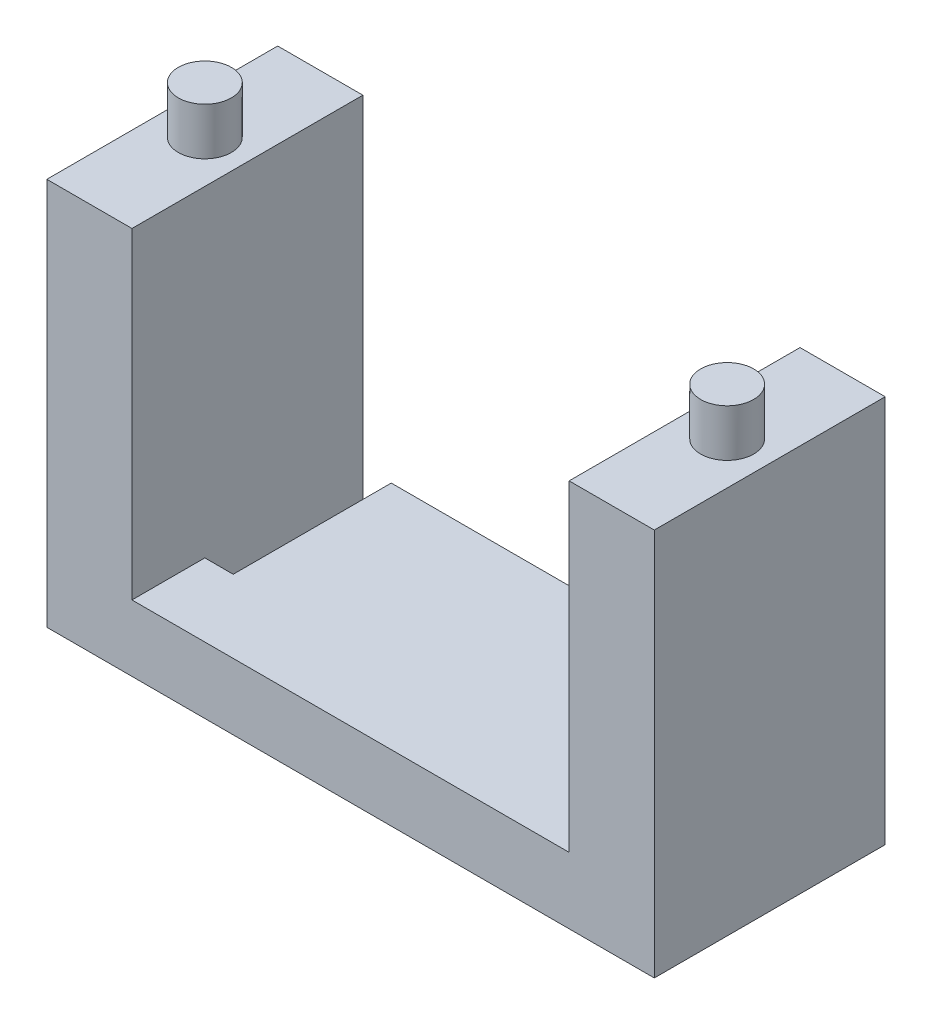
ISO-10303-21;
HEADER;
FILE_DESCRIPTION(('STEP AP214'),'2;1');
FILE_NAME('part.step','',(''),(''),'','','');
FILE_SCHEMA(('AUTOMOTIVE_DESIGN { 1 0 10303 214 1 1 1 1 }'));
ENDSEC;
DATA;
#1=APPLICATION_CONTEXT('core data for automotive mechanical design processes');
#2=APPLICATION_PROTOCOL_DEFINITION('international standard','automotive_design',2000,#1);
#3=PRODUCT_CONTEXT('',#1,'mechanical');
#4=PRODUCT('Part','Part','',(#3));
#5=PRODUCT_RELATED_PRODUCT_CATEGORY('part','',(#4));
#6=PRODUCT_DEFINITION_FORMATION('','',#4);
#7=PRODUCT_DEFINITION_CONTEXT('part definition',#1,'design');
#8=PRODUCT_DEFINITION('design','',#6,#7);
#9=PRODUCT_DEFINITION_SHAPE('','',#8);
#10=(LENGTH_UNIT() NAMED_UNIT(*) SI_UNIT(.MILLI.,.METRE.));
#11=(NAMED_UNIT(*) PLANE_ANGLE_UNIT() SI_UNIT($,.RADIAN.));
#12=(NAMED_UNIT(*) SI_UNIT($,.STERADIAN.) SOLID_ANGLE_UNIT());
#13=UNCERTAINTY_MEASURE_WITH_UNIT(LENGTH_MEASURE(1.E-05),#10,'distance_accuracy_value','');
#14=(GEOMETRIC_REPRESENTATION_CONTEXT(3) GLOBAL_UNCERTAINTY_ASSIGNED_CONTEXT((#13)) GLOBAL_UNIT_ASSIGNED_CONTEXT((#10,
#11,#12)) REPRESENTATION_CONTEXT('',''));
#15=CARTESIAN_POINT('',(0.,0.,0.));
#16=DIRECTION('',(0.,0.,1.));
#17=DIRECTION('',(1.,0.,0.));
#18=AXIS2_PLACEMENT_3D('',#15,#16,#17);
#19=CARTESIAN_POINT('',(0.,0.,0.));
#20=DIRECTION('',(0.,0.,1.));
#21=DIRECTION('',(1.,0.,0.));
#22=AXIS2_PLACEMENT_3D('',#19,#20,#21);
#23=PLANE('',#22);
#24=DIRECTION('',(0.,1.,0.));
#25=VECTOR('',#24,1.);
#26=CARTESIAN_POINT('',(16.05,-4.5,0.));
#27=LINE('',#26,#25);
#28=CARTESIAN_POINT('',(16.05,-3.5,0.));
#29=VERTEX_POINT('',#28);
#30=CARTESIAN_POINT('',(16.05,17.,0.));
#31=VERTEX_POINT('',#30);
#32=EDGE_CURVE('E131',#29,#31,#27,.T.);
#33=ORIENTED_EDGE('',*,*,#32,.F.);
#34=DIRECTION('',(1.,0.,0.));
#35=VECTOR('',#34,1.);
#36=CARTESIAN_POINT('',(-28.2909149984795,-3.5,0.));
#37=LINE('',#36,#35);
#38=CARTESIAN_POINT('',(-10.05,-3.5,0.));
#39=VERTEX_POINT('',#38);
#40=EDGE_CURVE('E253',#39,#29,#37,.T.);
#41=ORIENTED_EDGE('',*,*,#40,.F.);
#42=DIRECTION('',(0.,1.,0.));
#43=VECTOR('',#42,1.);
#44=CARTESIAN_POINT('',(-10.05,0.,0.));
#45=LINE('',#44,#43);
#46=CARTESIAN_POINT('',(-10.05,0.,0.));
#47=VERTEX_POINT('',#46);
#48=EDGE_CURVE('E154',#39,#47,#45,.T.);
#49=ORIENTED_EDGE('',*,*,#48,.T.);
#50=DIRECTION('',(-1.,0.,0.));
#51=VECTOR('',#50,1.);
#52=CARTESIAN_POINT('',(-11.55,0.,0.));
#53=LINE('',#52,#51);
#54=CARTESIAN_POINT('',(11.55,0.,0.));
#55=VERTEX_POINT('',#54);
#56=EDGE_CURVE('E137',#55,#47,#53,.T.);
#57=ORIENTED_EDGE('',*,*,#56,.F.);
#58=DIRECTION('',(0.,-1.,0.));
#59=VECTOR('',#58,1.);
#60=CARTESIAN_POINT('',(11.55,0.,0.));
#61=LINE('',#60,#59);
#62=CARTESIAN_POINT('',(11.55,17.,0.));
#63=VERTEX_POINT('',#62);
#64=EDGE_CURVE('E135',#63,#55,#61,.T.);
#65=ORIENTED_EDGE('',*,*,#64,.F.);
#66=DIRECTION('',(-1.,0.,0.));
#67=VECTOR('',#66,1.);
#68=CARTESIAN_POINT('',(11.55,17.,0.));
#69=LINE('',#68,#67);
#70=EDGE_CURVE('E133',#31,#63,#69,.T.);
#71=ORIENTED_EDGE('',*,*,#70,.F.);
#72=EDGE_LOOP('',(#33,#41,#49,#57,#65,#71));
#73=FACE_BOUND('',#72,.T.);
#74=ADVANCED_FACE('F32',(#73),#23,.F.);
#75=CARTESIAN_POINT('',(16.05,-4.5,12.2));
#76=DIRECTION('',(-1.,0.,0.));
#77=DIRECTION('',(0.,0.,1.));
#78=AXIS2_PLACEMENT_3D('',#75,#76,#77);
#79=PLANE('',#78);
#80=DIRECTION('',(0.,1.,0.));
#81=VECTOR('',#80,1.);
#82=CARTESIAN_POINT('',(16.05,-4.5,12.2));
#83=LINE('',#82,#81);
#84=CARTESIAN_POINT('',(16.05,-3.5,12.2));
#85=VERTEX_POINT('',#84);
#86=CARTESIAN_POINT('',(16.05,17.,12.2));
#87=VERTEX_POINT('',#86);
#88=EDGE_CURVE('E87',#85,#87,#83,.T.);
#89=ORIENTED_EDGE('',*,*,#88,.F.);
#90=DIRECTION('',(0.,0.,-1.));
#91=VECTOR('',#90,1.);
#92=CARTESIAN_POINT('',(16.05,-3.5,12.2));
#93=LINE('',#92,#91);
#94=EDGE_CURVE('E255',#85,#29,#93,.T.);
#95=ORIENTED_EDGE('',*,*,#94,.T.);
#96=ORIENTED_EDGE('',*,*,#32,.T.);
#97=DIRECTION('',(0.,0.,-1.));
#98=VECTOR('',#97,1.);
#99=CARTESIAN_POINT('',(16.05,17.,12.2));
#100=LINE('',#99,#98);
#101=EDGE_CURVE('E151',#87,#31,#100,.T.);
#102=ORIENTED_EDGE('',*,*,#101,.F.);
#103=EDGE_LOOP('',(#89,#95,#96,#102));
#104=FACE_BOUND('',#103,.T.);
#105=ADVANCED_FACE('F34',(#104),#79,.F.);
#106=CARTESIAN_POINT('',(11.55,17.,12.2));
#107=DIRECTION('',(0.,-1.,0.));
#108=DIRECTION('',(0.,0.,-1.));
#109=AXIS2_PLACEMENT_3D('',#106,#107,#108);
#110=PLANE('',#109);
#111=CARTESIAN_POINT('',(13.8,17.,6.1));
#112=DIRECTION('',(0.,-1.,0.));
#113=DIRECTION('',(0.,0.,-1.));
#114=AXIS2_PLACEMENT_3D('',#111,#112,#113);
#115=CIRCLE('',#114,1.4);
#116=CARTESIAN_POINT('',(13.8,17.,4.7));
#117=VERTEX_POINT('',#116);
#118=EDGE_CURVE('E157',#117,#117,#115,.F.);
#119=ORIENTED_EDGE('',*,*,#118,.F.);
#120=EDGE_LOOP('',(#119));
#121=FACE_BOUND('',#120,.T.);
#122=ORIENTED_EDGE('',*,*,#70,.T.);
#123=DIRECTION('',(0.,0.,-1.));
#124=VECTOR('',#123,1.);
#125=CARTESIAN_POINT('',(11.55,17.,12.2));
#126=LINE('',#125,#124);
#127=CARTESIAN_POINT('',(11.55,17.,12.2));
#128=VERTEX_POINT('',#127);
#129=EDGE_CURVE('E148',#128,#63,#126,.T.);
#130=ORIENTED_EDGE('',*,*,#129,.F.);
#131=DIRECTION('',(-1.,0.,0.));
#132=VECTOR('',#131,1.);
#133=CARTESIAN_POINT('',(11.55,17.,12.2));
#134=LINE('',#133,#132);
#135=EDGE_CURVE('E245',#87,#128,#134,.T.);
#136=ORIENTED_EDGE('',*,*,#135,.F.);
#137=ORIENTED_EDGE('',*,*,#101,.T.);
#138=EDGE_LOOP('',(#122,#130,#136,#137));
#139=FACE_BOUND('',#138,.T.);
#140=ADVANCED_FACE('F182',(#121,#139),#110,.F.);
#141=CARTESIAN_POINT('',(11.55,0.,12.2));
#142=DIRECTION('',(1.,0.,0.));
#143=DIRECTION('',(0.,0.,-1.));
#144=AXIS2_PLACEMENT_3D('',#141,#142,#143);
#145=PLANE('',#144);
#146=ORIENTED_EDGE('',*,*,#64,.T.);
#147=DIRECTION('',(0.,0.,-1.));
#148=VECTOR('',#147,1.);
#149=CARTESIAN_POINT('',(11.55,0.,12.2));
#150=LINE('',#149,#148);
#151=CARTESIAN_POINT('',(11.55,0.,12.2));
#152=VERTEX_POINT('',#151);
#153=EDGE_CURVE('E120',#152,#55,#150,.T.);
#154=ORIENTED_EDGE('',*,*,#153,.F.);
#155=DIRECTION('',(0.,-1.,0.));
#156=VECTOR('',#155,1.);
#157=CARTESIAN_POINT('',(11.55,0.,12.2));
#158=LINE('',#157,#156);
#159=EDGE_CURVE('E104',#128,#152,#158,.T.);
#160=ORIENTED_EDGE('',*,*,#159,.F.);
#161=ORIENTED_EDGE('',*,*,#129,.T.);
#162=EDGE_LOOP('',(#146,#154,#160,#161));
#163=FACE_BOUND('',#162,.T.);
#164=ADVANCED_FACE('F252',(#163),#145,.F.);
#165=CARTESIAN_POINT('',(-11.55,0.,12.2));
#166=DIRECTION('',(0.,-1.,0.));
#167=DIRECTION('',(0.,0.,-1.));
#168=AXIS2_PLACEMENT_3D('',#165,#166,#167);
#169=PLANE('',#168);
#170=ORIENTED_EDGE('',*,*,#56,.T.);
#171=DIRECTION('',(0.,0.,1.));
#172=VECTOR('',#171,1.);
#173=CARTESIAN_POINT('',(-10.05,0.,12.2));
#174=LINE('',#173,#172);
#175=CARTESIAN_POINT('',(-10.05,0.,8.35));
#176=VERTEX_POINT('',#175);
#177=EDGE_CURVE('E236',#47,#176,#174,.T.);
#178=ORIENTED_EDGE('',*,*,#177,.T.);
#179=DIRECTION('',(-1.,0.,0.));
#180=VECTOR('',#179,1.);
#181=CARTESIAN_POINT('',(-11.55,0.,8.35));
#182=LINE('',#181,#180);
#183=CARTESIAN_POINT('',(-11.55,0.,8.35));
#184=VERTEX_POINT('',#183);
#185=EDGE_CURVE('E117',#176,#184,#182,.T.);
#186=ORIENTED_EDGE('',*,*,#185,.T.);
#187=DIRECTION('',(0.,0.,-1.));
#188=VECTOR('',#187,1.);
#189=CARTESIAN_POINT('',(-11.55,0.,12.2));
#190=LINE('',#189,#188);
#191=CARTESIAN_POINT('',(-11.55,0.,12.2));
#192=VERTEX_POINT('',#191);
#193=EDGE_CURVE('E111',#192,#184,#190,.T.);
#194=ORIENTED_EDGE('',*,*,#193,.F.);
#195=DIRECTION('',(-1.,0.,0.));
#196=VECTOR('',#195,1.);
#197=CARTESIAN_POINT('',(-11.55,0.,12.2));
#198=LINE('',#197,#196);
#199=EDGE_CURVE('E97',#152,#192,#198,.T.);
#200=ORIENTED_EDGE('',*,*,#199,.F.);
#201=ORIENTED_EDGE('',*,*,#153,.T.);
#202=EDGE_LOOP('',(#170,#178,#186,#194,#200,#201));
#203=FACE_BOUND('',#202,.T.);
#204=ADVANCED_FACE('F113',(#203),#169,.F.);
#205=CARTESIAN_POINT('',(-11.55,0.,12.2));
#206=DIRECTION('',(-1.,0.,0.));
#207=DIRECTION('',(0.,0.,1.));
#208=AXIS2_PLACEMENT_3D('',#205,#206,#207);
#209=PLANE('',#208);
#210=DIRECTION('',(0.,-1.,0.));
#211=VECTOR('',#210,1.);
#212=CARTESIAN_POINT('',(-11.55,17.,8.35));
#213=LINE('',#212,#211);
#214=CARTESIAN_POINT('',(-11.55,-3.5,8.35));
#215=VERTEX_POINT('',#214);
#216=EDGE_CURVE('E235',#184,#215,#213,.T.);
#217=ORIENTED_EDGE('',*,*,#216,.T.);
#218=DIRECTION('',(0.,0.,-1.));
#219=VECTOR('',#218,1.);
#220=CARTESIAN_POINT('',(-11.55,-3.5,12.2));
#221=LINE('',#220,#219);
#222=CARTESIAN_POINT('',(-11.55,-3.5,0.));
#223=VERTEX_POINT('',#222);
#224=EDGE_CURVE('E206',#215,#223,#221,.T.);
#225=ORIENTED_EDGE('',*,*,#224,.T.);
#226=DIRECTION('',(0.,1.,0.));
#227=VECTOR('',#226,1.);
#228=CARTESIAN_POINT('',(-11.55,0.,0.));
#229=LINE('',#228,#227);
#230=CARTESIAN_POINT('',(-11.55,17.,0.));
#231=VERTEX_POINT('',#230);
#232=EDGE_CURVE('E139',#223,#231,#229,.T.);
#233=ORIENTED_EDGE('',*,*,#232,.T.);
#234=DIRECTION('',(0.,0.,-1.));
#235=VECTOR('',#234,1.);
#236=CARTESIAN_POINT('',(-11.55,17.,12.2));
#237=LINE('',#236,#235);
#238=CARTESIAN_POINT('',(-11.55,17.,12.2));
#239=VERTEX_POINT('',#238);
#240=EDGE_CURVE('E121',#239,#231,#237,.T.);
#241=ORIENTED_EDGE('',*,*,#240,.F.);
#242=DIRECTION('',(0.,1.,0.));
#243=VECTOR('',#242,1.);
#244=CARTESIAN_POINT('',(-11.55,0.,12.2));
#245=LINE('',#244,#243);
#246=EDGE_CURVE('E101',#192,#239,#245,.T.);
#247=ORIENTED_EDGE('',*,*,#246,.F.);
#248=ORIENTED_EDGE('',*,*,#193,.T.);
#249=EDGE_LOOP('',(#217,#225,#233,#241,#247,#248));
#250=FACE_BOUND('',#249,.T.);
#251=ADVANCED_FACE('F123',(#250),#209,.F.);
#252=CARTESIAN_POINT('',(-11.55,17.,12.2));
#253=DIRECTION('',(0.,-1.,0.));
#254=DIRECTION('',(0.,0.,-1.));
#255=AXIS2_PLACEMENT_3D('',#252,#253,#254);
#256=PLANE('',#255);
#257=CARTESIAN_POINT('',(-13.8,17.,6.1));
#258=DIRECTION('',(0.,-1.,0.));
#259=DIRECTION('',(0.,0.,-1.));
#260=AXIS2_PLACEMENT_3D('',#257,#258,#259);
#261=CIRCLE('',#260,1.4);
#262=CARTESIAN_POINT('',(-13.8,17.,4.7));
#263=VERTEX_POINT('',#262);
#264=EDGE_CURVE('E40',#263,#263,#261,.F.);
#265=ORIENTED_EDGE('',*,*,#264,.F.);
#266=EDGE_LOOP('',(#265));
#267=FACE_BOUND('',#266,.T.);
#268=DIRECTION('',(-1.,0.,0.));
#269=VECTOR('',#268,1.);
#270=CARTESIAN_POINT('',(-11.55,17.,0.));
#271=LINE('',#270,#269);
#272=CARTESIAN_POINT('',(-16.05,17.,0.));
#273=VERTEX_POINT('',#272);
#274=EDGE_CURVE('E79',#231,#273,#271,.T.);
#275=ORIENTED_EDGE('',*,*,#274,.T.);
#276=DIRECTION('',(0.,0.,-1.));
#277=VECTOR('',#276,1.);
#278=CARTESIAN_POINT('',(-16.05,17.,12.2));
#279=LINE('',#278,#277);
#280=CARTESIAN_POINT('',(-16.05,17.,12.2));
#281=VERTEX_POINT('',#280);
#282=EDGE_CURVE('E130',#281,#273,#279,.T.);
#283=ORIENTED_EDGE('',*,*,#282,.F.);
#284=DIRECTION('',(-1.,0.,0.));
#285=VECTOR('',#284,1.);
#286=CARTESIAN_POINT('',(-11.55,17.,12.2));
#287=LINE('',#286,#285);
#288=EDGE_CURVE('E55',#239,#281,#287,.T.);
#289=ORIENTED_EDGE('',*,*,#288,.F.);
#290=ORIENTED_EDGE('',*,*,#240,.T.);
#291=EDGE_LOOP('',(#275,#283,#289,#290));
#292=FACE_BOUND('',#291,.T.);
#293=ADVANCED_FACE('F164',(#267,#292),#256,.F.);
#294=CARTESIAN_POINT('',(-16.05,-4.5,12.2));
#295=DIRECTION('',(1.,0.,0.));
#296=DIRECTION('',(0.,0.,-1.));
#297=AXIS2_PLACEMENT_3D('',#294,#295,#296);
#298=PLANE('',#297);
#299=DIRECTION('',(0.,-1.,0.));
#300=VECTOR('',#299,1.);
#301=CARTESIAN_POINT('',(-16.05,-4.5,0.));
#302=LINE('',#301,#300);
#303=CARTESIAN_POINT('',(-16.05,-3.5,0.));
#304=VERTEX_POINT('',#303);
#305=EDGE_CURVE('E142',#273,#304,#302,.T.);
#306=ORIENTED_EDGE('',*,*,#305,.T.);
#307=DIRECTION('',(0.,0.,-1.));
#308=VECTOR('',#307,1.);
#309=CARTESIAN_POINT('',(-16.05,-3.5,12.2));
#310=LINE('',#309,#308);
#311=CARTESIAN_POINT('',(-16.05,-3.5,12.2));
#312=VERTEX_POINT('',#311);
#313=EDGE_CURVE('E211',#312,#304,#310,.T.);
#314=ORIENTED_EDGE('',*,*,#313,.F.);
#315=DIRECTION('',(0.,-1.,0.));
#316=VECTOR('',#315,1.);
#317=CARTESIAN_POINT('',(-16.05,-4.5,12.2));
#318=LINE('',#317,#316);
#319=EDGE_CURVE('E125',#281,#312,#318,.T.);
#320=ORIENTED_EDGE('',*,*,#319,.F.);
#321=ORIENTED_EDGE('',*,*,#282,.T.);
#322=EDGE_LOOP('',(#306,#314,#320,#321));
#323=FACE_BOUND('',#322,.T.);
#324=ADVANCED_FACE('F166',(#323),#298,.F.);
#325=CARTESIAN_POINT('',(0.,0.,12.2));
#326=DIRECTION('',(0.,0.,1.));
#327=DIRECTION('',(1.,0.,0.));
#328=AXIS2_PLACEMENT_3D('',#325,#326,#327);
#329=PLANE('',#328);
#330=DIRECTION('',(1.,0.,0.));
#331=VECTOR('',#330,1.);
#332=CARTESIAN_POINT('',(-28.2909149984795,-3.5,12.2));
#333=LINE('',#332,#331);
#334=EDGE_CURVE('E214',#312,#85,#333,.T.);
#335=ORIENTED_EDGE('',*,*,#334,.T.);
#336=ORIENTED_EDGE('',*,*,#88,.T.);
#337=ORIENTED_EDGE('',*,*,#135,.T.);
#338=ORIENTED_EDGE('',*,*,#159,.T.);
#339=ORIENTED_EDGE('',*,*,#199,.T.);
#340=ORIENTED_EDGE('',*,*,#246,.T.);
#341=ORIENTED_EDGE('',*,*,#288,.T.);
#342=ORIENTED_EDGE('',*,*,#319,.T.);
#343=EDGE_LOOP('',(#335,#336,#337,#338,#339,#340,#341,#342));
#344=FACE_BOUND('',#343,.T.);
#345=ADVANCED_FACE('F99',(#344),#329,.T.);
#346=ORIENTED_EDGE('',*,*,#232,.F.);
#347=EDGE_CURVE('E202',#304,#223,#37,.T.);
#348=ORIENTED_EDGE('',*,*,#347,.F.);
#349=ORIENTED_EDGE('',*,*,#305,.F.);
#350=ORIENTED_EDGE('',*,*,#274,.F.);
#351=EDGE_LOOP('',(#346,#348,#349,#350));
#352=FACE_BOUND('',#351,.T.);
#353=ADVANCED_FACE('F178',(#352),#23,.F.);
#354=CARTESIAN_POINT('',(-11.55,17.,8.35));
#355=DIRECTION('',(0.,0.,1.));
#356=DIRECTION('',(1.,0.,0.));
#357=AXIS2_PLACEMENT_3D('',#354,#355,#356);
#358=PLANE('',#357);
#359=DIRECTION('',(0.,-1.,0.));
#360=VECTOR('',#359,1.);
#361=CARTESIAN_POINT('',(-10.05,17.,8.35));
#362=LINE('',#361,#360);
#363=CARTESIAN_POINT('',(-10.05,-3.5,8.35));
#364=VERTEX_POINT('',#363);
#365=EDGE_CURVE('E234',#176,#364,#362,.T.);
#366=ORIENTED_EDGE('',*,*,#365,.T.);
#367=DIRECTION('',(-1.,0.,0.));
#368=VECTOR('',#367,1.);
#369=CARTESIAN_POINT('',(-11.55,-3.5,8.35));
#370=LINE('',#369,#368);
#371=EDGE_CURVE('E47',#364,#215,#370,.T.);
#372=ORIENTED_EDGE('',*,*,#371,.T.);
#373=ORIENTED_EDGE('',*,*,#216,.F.);
#374=ORIENTED_EDGE('',*,*,#185,.F.);
#375=EDGE_LOOP('',(#366,#372,#373,#374));
#376=FACE_BOUND('',#375,.T.);
#377=ADVANCED_FACE('F187',(#376),#358,.F.);
#378=CARTESIAN_POINT('',(-10.05,17.,8.35));
#379=DIRECTION('',(1.,0.,0.));
#380=DIRECTION('',(0.,0.,-1.));
#381=AXIS2_PLACEMENT_3D('',#378,#379,#380);
#382=PLANE('',#381);
#383=ORIENTED_EDGE('',*,*,#48,.F.);
#384=DIRECTION('',(0.,0.,1.));
#385=VECTOR('',#384,1.);
#386=CARTESIAN_POINT('',(-10.05,-3.5,8.35));
#387=LINE('',#386,#385);
#388=EDGE_CURVE('E11',#39,#364,#387,.T.);
#389=ORIENTED_EDGE('',*,*,#388,.T.);
#390=ORIENTED_EDGE('',*,*,#365,.F.);
#391=ORIENTED_EDGE('',*,*,#177,.F.);
#392=EDGE_LOOP('',(#383,#389,#390,#391));
#393=FACE_BOUND('',#392,.T.);
#394=ADVANCED_FACE('F193',(#393),#382,.F.);
#395=CARTESIAN_POINT('',(13.8,19.5,6.1));
#396=DIRECTION('',(0.,-1.,0.));
#397=DIRECTION('',(0.,0.,-1.));
#398=AXIS2_PLACEMENT_3D('',#395,#396,#397);
#399=CYLINDRICAL_SURFACE('',#398,1.4);
#400=CARTESIAN_POINT('',(13.8,19.5,6.1));
#401=DIRECTION('',(0.,1.,0.));
#402=DIRECTION('',(0.,0.,1.));
#403=AXIS2_PLACEMENT_3D('',#400,#401,#402);
#404=CIRCLE('',#403,1.4);
#405=CARTESIAN_POINT('',(13.8,19.5,7.5));
#406=VERTEX_POINT('',#405);
#407=EDGE_CURVE('E239',#406,#406,#404,.T.);
#408=ORIENTED_EDGE('',*,*,#407,.F.);
#409=EDGE_LOOP('',(#408));
#410=FACE_BOUND('',#409,.T.);
#411=ORIENTED_EDGE('',*,*,#118,.T.);
#412=EDGE_LOOP('',(#411));
#413=FACE_BOUND('',#412,.T.);
#414=ADVANCED_FACE('F268',(#410,#413),#399,.T.);
#415=CARTESIAN_POINT('',(13.8,19.5,6.1));
#416=DIRECTION('',(0.,1.,0.));
#417=DIRECTION('',(0.,0.,1.));
#418=AXIS2_PLACEMENT_3D('',#415,#416,#417);
#419=PLANE('',#418);
#420=ORIENTED_EDGE('',*,*,#407,.T.);
#421=EDGE_LOOP('',(#420));
#422=FACE_BOUND('',#421,.T.);
#423=ADVANCED_FACE('F266',(#422),#419,.T.);
#424=CARTESIAN_POINT('',(-13.8,19.5,6.1));
#425=DIRECTION('',(0.,-1.,0.));
#426=DIRECTION('',(0.,0.,-1.));
#427=AXIS2_PLACEMENT_3D('',#424,#425,#426);
#428=CYLINDRICAL_SURFACE('',#427,1.4);
#429=CARTESIAN_POINT('',(-13.8,19.5,6.1));
#430=DIRECTION('',(0.,1.,0.));
#431=DIRECTION('',(0.,0.,-1.));
#432=AXIS2_PLACEMENT_3D('',#429,#430,#431);
#433=CIRCLE('',#432,1.4);
#434=CARTESIAN_POINT('',(-13.8,19.5,4.7));
#435=VERTEX_POINT('',#434);
#436=EDGE_CURVE('E256',#435,#435,#433,.T.);
#437=ORIENTED_EDGE('',*,*,#436,.F.);
#438=EDGE_LOOP('',(#437));
#439=FACE_BOUND('',#438,.T.);
#440=ORIENTED_EDGE('',*,*,#264,.T.);
#441=EDGE_LOOP('',(#440));
#442=FACE_BOUND('',#441,.T.);
#443=ADVANCED_FACE('F162',(#439,#442),#428,.T.);
#444=CARTESIAN_POINT('',(-13.8,19.5,6.1));
#445=DIRECTION('',(0.,-1.,0.));
#446=DIRECTION('',(0.,0.,-1.));
#447=AXIS2_PLACEMENT_3D('',#444,#445,#446);
#448=PLANE('',#447);
#449=ORIENTED_EDGE('',*,*,#436,.T.);
#450=EDGE_LOOP('',(#449));
#451=FACE_BOUND('',#450,.T.);
#452=ADVANCED_FACE('F335',(#451),#448,.F.);
#453=CARTESIAN_POINT('',(-28.2909149984795,-3.5,12.2));
#454=DIRECTION('',(0.,1.,0.));
#455=DIRECTION('',(0.,0.,1.));
#456=AXIS2_PLACEMENT_3D('',#453,#454,#455);
#457=PLANE('',#456);
#458=ORIENTED_EDGE('',*,*,#334,.F.);
#459=ORIENTED_EDGE('',*,*,#313,.T.);
#460=ORIENTED_EDGE('',*,*,#347,.T.);
#461=ORIENTED_EDGE('',*,*,#224,.F.);
#462=ORIENTED_EDGE('',*,*,#371,.F.);
#463=ORIENTED_EDGE('',*,*,#388,.F.);
#464=ORIENTED_EDGE('',*,*,#40,.T.);
#465=ORIENTED_EDGE('',*,*,#94,.F.);
#466=EDGE_LOOP('',(#458,#459,#460,#461,#462,#463,#464,#465));
#467=FACE_BOUND('',#466,.T.);
#468=ADVANCED_FACE('F331',(#467),#457,.F.);
#469=CLOSED_SHELL('',(#74,#105,#140,#164,#204,#251,#293,#324,#345,#353,#377,#394,#414,#423,#443,
#452,#468));
#470=MANIFOLD_SOLID_BREP('B2',#469);
#471=ADVANCED_BREP_SHAPE_REPRESENTATION('',(#18,#470),#14);
#472=SHAPE_DEFINITION_REPRESENTATION(#9,#471);
ENDSEC;
END-ISO-10303-21;
